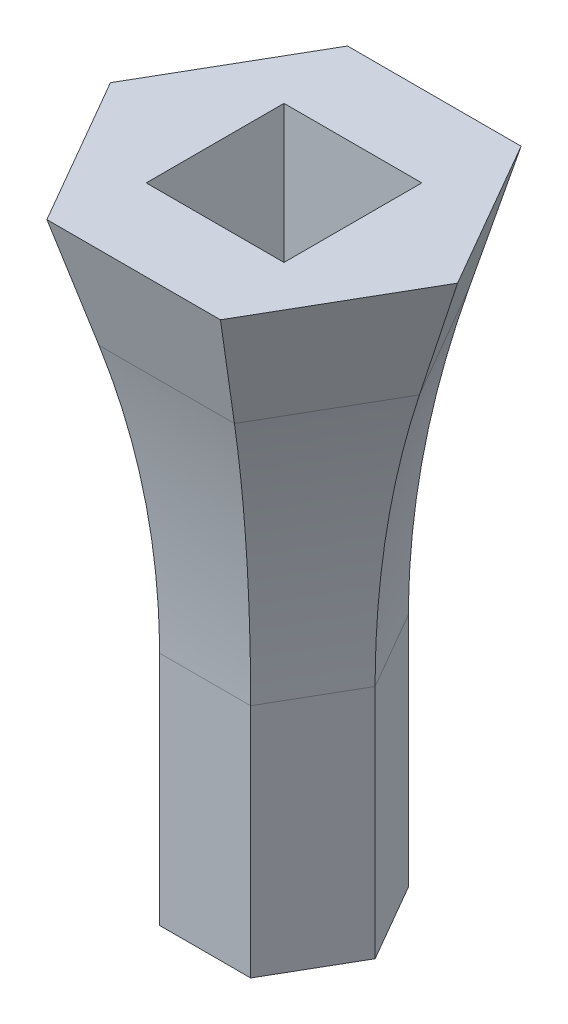
ISO-10303-21;
HEADER;
FILE_DESCRIPTION(('STEP AP214'),'2;1');
FILE_NAME('part.step','',(''),(''),'','','');
FILE_SCHEMA(('AUTOMOTIVE_DESIGN { 1 0 10303 214 1 1 1 1 }'));
ENDSEC;
DATA;
#1=APPLICATION_CONTEXT('core data for automotive mechanical design processes');
#2=APPLICATION_PROTOCOL_DEFINITION('international standard','automotive_design',2000,#1);
#3=PRODUCT_CONTEXT('',#1,'mechanical');
#4=PRODUCT('Part','Part','',(#3));
#5=PRODUCT_RELATED_PRODUCT_CATEGORY('part','',(#4));
#6=PRODUCT_DEFINITION_FORMATION('','',#4);
#7=PRODUCT_DEFINITION_CONTEXT('part definition',#1,'design');
#8=PRODUCT_DEFINITION('design','',#6,#7);
#9=PRODUCT_DEFINITION_SHAPE('','',#8);
#10=(LENGTH_UNIT() NAMED_UNIT(*) SI_UNIT(.MILLI.,.METRE.));
#11=(NAMED_UNIT(*) PLANE_ANGLE_UNIT() SI_UNIT($,.RADIAN.));
#12=(NAMED_UNIT(*) SI_UNIT($,.STERADIAN.) SOLID_ANGLE_UNIT());
#13=UNCERTAINTY_MEASURE_WITH_UNIT(LENGTH_MEASURE(1.E-05),#10,'distance_accuracy_value','');
#14=(GEOMETRIC_REPRESENTATION_CONTEXT(3) GLOBAL_UNCERTAINTY_ASSIGNED_CONTEXT((#13)) GLOBAL_UNIT_ASSIGNED_CONTEXT((#10,
#11,#12)) REPRESENTATION_CONTEXT('',''));
#15=CARTESIAN_POINT('',(0.,0.,0.));
#16=DIRECTION('',(0.,0.,1.));
#17=DIRECTION('',(1.,0.,0.));
#18=AXIS2_PLACEMENT_3D('',#15,#16,#17);
#19=CARTESIAN_POINT('',(-1.81865334794732,15.,3.15));
#20=DIRECTION('',(0.,0.,-1.));
#21=DIRECTION('',(-1.,0.,0.));
#22=AXIS2_PLACEMENT_3D('',#19,#20,#21);
#23=PLANE('',#22);
#24=DIRECTION('',(0.,-1.,0.));
#25=VECTOR('',#24,1.);
#26=CARTESIAN_POINT('',(1.81865334794732,15.,3.15));
#27=LINE('',#26,#25);
#28=CARTESIAN_POINT('',(1.81865334794732,9.41127074963327,3.15));
#29=VERTEX_POINT('',#28);
#30=CARTESIAN_POINT('',(1.81865334794732,0.,3.15));
#31=VERTEX_POINT('',#30);
#32=EDGE_CURVE('E483',#29,#31,#27,.T.);
#33=ORIENTED_EDGE('',*,*,#32,.F.);
#34=DIRECTION('',(1.,0.,0.));
#35=VECTOR('',#34,1.);
#36=CARTESIAN_POINT('',(-1.81865334794732,9.41127074963327,3.15));
#37=LINE('',#36,#35);
#38=CARTESIAN_POINT('',(-1.81865334794732,9.4112707496333,3.15));
#39=VERTEX_POINT('',#38);
#40=EDGE_CURVE('E482',#29,#39,#37,.F.);
#41=ORIENTED_EDGE('',*,*,#40,.T.);
#42=DIRECTION('',(0.,-1.,0.));
#43=VECTOR('',#42,1.);
#44=CARTESIAN_POINT('',(-1.81865334794732,15.,3.15));
#45=LINE('',#44,#43);
#46=CARTESIAN_POINT('',(-1.81865334794732,0.,3.15));
#47=VERTEX_POINT('',#46);
#48=EDGE_CURVE('E506',#39,#47,#45,.T.);
#49=ORIENTED_EDGE('',*,*,#48,.T.);
#50=DIRECTION('',(1.,0.,0.));
#51=VECTOR('',#50,1.);
#52=CARTESIAN_POINT('',(-1.81865334794732,0.,3.15));
#53=LINE('',#52,#51);
#54=EDGE_CURVE('E524',#47,#31,#53,.T.);
#55=ORIENTED_EDGE('',*,*,#54,.T.);
#56=EDGE_LOOP('',(#33,#41,#49,#55));
#57=FACE_BOUND('',#56,.T.);
#58=ADVANCED_FACE('F47',(#57),#23,.F.);
#59=CARTESIAN_POINT('',(1.81865334794732,15.,3.15));
#60=DIRECTION('',(-0.866025403784438,0.,-0.5));
#61=DIRECTION('',(-0.5,0.,0.866025403784439));
#62=AXIS2_PLACEMENT_3D('',#59,#60,#61);
#63=PLANE('',#62);
#64=DIRECTION('',(0.,-1.,0.));
#65=VECTOR('',#64,1.);
#66=CARTESIAN_POINT('',(3.63730669589464,15.,0.));
#67=LINE('',#66,#65);
#68=CARTESIAN_POINT('',(3.63730669589464,9.41127074963329,0.));
#69=VERTEX_POINT('',#68);
#70=CARTESIAN_POINT('',(3.63730669589464,0.,0.));
#71=VERTEX_POINT('',#70);
#72=EDGE_CURVE('E487',#69,#71,#67,.T.);
#73=ORIENTED_EDGE('',*,*,#72,.F.);
#74=DIRECTION('',(0.5,0.,-0.866025403784439));
#75=VECTOR('',#74,1.);
#76=CARTESIAN_POINT('',(1.81865334794733,9.41127074963327,3.15));
#77=LINE('',#76,#75);
#78=EDGE_CURVE('E536',#69,#29,#77,.F.);
#79=ORIENTED_EDGE('',*,*,#78,.T.);
#80=ORIENTED_EDGE('',*,*,#32,.T.);
#81=DIRECTION('',(0.5,0.,-0.866025403784439));
#82=VECTOR('',#81,1.);
#83=CARTESIAN_POINT('',(1.81865334794732,0.,3.15));
#84=LINE('',#83,#82);
#85=EDGE_CURVE('E521',#31,#71,#84,.T.);
#86=ORIENTED_EDGE('',*,*,#85,.T.);
#87=EDGE_LOOP('',(#73,#79,#80,#86));
#88=FACE_BOUND('',#87,.T.);
#89=ADVANCED_FACE('F356',(#88),#63,.F.);
#90=CARTESIAN_POINT('',(3.63730669589464,15.,0.));
#91=DIRECTION('',(-0.866025403784439,0.,0.5));
#92=DIRECTION('',(0.5,0.,0.866025403784439));
#93=AXIS2_PLACEMENT_3D('',#90,#91,#92);
#94=PLANE('',#93);
#95=DIRECTION('',(0.,-1.,0.));
#96=VECTOR('',#95,1.);
#97=CARTESIAN_POINT('',(1.81865334794732,15.,-3.15));
#98=LINE('',#97,#96);
#99=CARTESIAN_POINT('',(1.81865334794732,9.41127074963327,-3.15));
#100=VERTEX_POINT('',#99);
#101=CARTESIAN_POINT('',(1.81865334794732,0.,-3.15));
#102=VERTEX_POINT('',#101);
#103=EDGE_CURVE('E500',#100,#102,#98,.T.);
#104=ORIENTED_EDGE('',*,*,#103,.F.);
#105=DIRECTION('',(-0.5,0.,-0.866025403784439));
#106=VECTOR('',#105,1.);
#107=CARTESIAN_POINT('',(3.63730669589465,9.41127074963329,0.));
#108=LINE('',#107,#106);
#109=EDGE_CURVE('E249',#100,#69,#108,.F.);
#110=ORIENTED_EDGE('',*,*,#109,.T.);
#111=ORIENTED_EDGE('',*,*,#72,.T.);
#112=DIRECTION('',(-0.5,0.,-0.866025403784439));
#113=VECTOR('',#112,1.);
#114=CARTESIAN_POINT('',(3.63730669589464,0.,0.));
#115=LINE('',#114,#113);
#116=EDGE_CURVE('E518',#71,#102,#115,.T.);
#117=ORIENTED_EDGE('',*,*,#116,.T.);
#118=EDGE_LOOP('',(#104,#110,#111,#117));
#119=FACE_BOUND('',#118,.T.);
#120=ADVANCED_FACE('F353',(#119),#94,.F.);
#121=CARTESIAN_POINT('',(1.81865334794732,15.,-3.15));
#122=DIRECTION('',(0.,0.,1.));
#123=DIRECTION('',(1.,0.,0.));
#124=AXIS2_PLACEMENT_3D('',#121,#122,#123);
#125=PLANE('',#124);
#126=DIRECTION('',(0.,-1.,0.));
#127=VECTOR('',#126,1.);
#128=CARTESIAN_POINT('',(-1.81865334794732,15.,-3.15));
#129=LINE('',#128,#127);
#130=CARTESIAN_POINT('',(-1.81865334794732,9.41127074963328,-3.15));
#131=VERTEX_POINT('',#130);
#132=CARTESIAN_POINT('',(-1.81865334794732,0.,-3.15));
#133=VERTEX_POINT('',#132);
#134=EDGE_CURVE('E502',#131,#133,#129,.T.);
#135=ORIENTED_EDGE('',*,*,#134,.F.);
#136=DIRECTION('',(-1.,0.,0.));
#137=VECTOR('',#136,1.);
#138=CARTESIAN_POINT('',(1.81865334794732,9.41127074963327,-3.15));
#139=LINE('',#138,#137);
#140=EDGE_CURVE('E215',#131,#100,#139,.F.);
#141=ORIENTED_EDGE('',*,*,#140,.T.);
#142=ORIENTED_EDGE('',*,*,#103,.T.);
#143=DIRECTION('',(-1.,0.,0.));
#144=VECTOR('',#143,1.);
#145=CARTESIAN_POINT('',(1.81865334794732,0.,-3.15));
#146=LINE('',#145,#144);
#147=EDGE_CURVE('E515',#102,#133,#146,.T.);
#148=ORIENTED_EDGE('',*,*,#147,.T.);
#149=EDGE_LOOP('',(#135,#141,#142,#148));
#150=FACE_BOUND('',#149,.T.);
#151=ADVANCED_FACE('F349',(#150),#125,.F.);
#152=CARTESIAN_POINT('',(-1.81865334794732,15.,-3.15));
#153=DIRECTION('',(0.866025403784438,0.,0.5));
#154=DIRECTION('',(0.5,0.,-0.866025403784439));
#155=AXIS2_PLACEMENT_3D('',#152,#153,#154);
#156=PLANE('',#155);
#157=DIRECTION('',(0.,-1.,0.));
#158=VECTOR('',#157,1.);
#159=CARTESIAN_POINT('',(-3.63730669589464,15.,0.));
#160=LINE('',#159,#158);
#161=CARTESIAN_POINT('',(-3.63730669589464,9.4112707496333,0.));
#162=VERTEX_POINT('',#161);
#163=CARTESIAN_POINT('',(-3.63730669589464,0.,0.));
#164=VERTEX_POINT('',#163);
#165=EDGE_CURVE('E504',#162,#164,#160,.T.);
#166=ORIENTED_EDGE('',*,*,#165,.F.);
#167=DIRECTION('',(-0.5,0.,0.866025403784439));
#168=VECTOR('',#167,1.);
#169=CARTESIAN_POINT('',(-1.81865334794733,9.41127074963328,-3.15000000000001));
#170=LINE('',#169,#168);
#171=EDGE_CURVE('E218',#162,#131,#170,.F.);
#172=ORIENTED_EDGE('',*,*,#171,.T.);
#173=ORIENTED_EDGE('',*,*,#134,.T.);
#174=DIRECTION('',(-0.5,0.,0.866025403784438));
#175=VECTOR('',#174,1.);
#176=CARTESIAN_POINT('',(-1.81865334794732,0.,-3.15));
#177=LINE('',#176,#175);
#178=EDGE_CURVE('E512',#133,#164,#177,.T.);
#179=ORIENTED_EDGE('',*,*,#178,.T.);
#180=EDGE_LOOP('',(#166,#172,#173,#179));
#181=FACE_BOUND('',#180,.T.);
#182=ADVANCED_FACE('F346',(#181),#156,.F.);
#183=CARTESIAN_POINT('',(-3.63730669589464,15.,0.));
#184=DIRECTION('',(0.866025403784439,0.,-0.5));
#185=DIRECTION('',(-0.5,0.,-0.866025403784439));
#186=AXIS2_PLACEMENT_3D('',#183,#184,#185);
#187=PLANE('',#186);
#188=ORIENTED_EDGE('',*,*,#48,.F.);
#189=DIRECTION('',(0.5,0.,0.866025403784439));
#190=VECTOR('',#189,1.);
#191=CARTESIAN_POINT('',(-3.63730669589464,9.4112707496333,0.));
#192=LINE('',#191,#190);
#193=EDGE_CURVE('E12',#39,#162,#192,.F.);
#194=ORIENTED_EDGE('',*,*,#193,.T.);
#195=ORIENTED_EDGE('',*,*,#165,.T.);
#196=DIRECTION('',(0.5,0.,0.866025403784439));
#197=VECTOR('',#196,1.);
#198=CARTESIAN_POINT('',(-3.63730669589464,0.,0.));
#199=LINE('',#198,#197);
#200=EDGE_CURVE('E507',#164,#47,#199,.T.);
#201=ORIENTED_EDGE('',*,*,#200,.T.);
#202=EDGE_LOOP('',(#188,#194,#195,#201));
#203=FACE_BOUND('',#202,.T.);
#204=ADVANCED_FACE('F342',(#203),#187,.F.);
#205=CARTESIAN_POINT('',(0.,0.,0.));
#206=DIRECTION('',(0.,1.,0.));
#207=DIRECTION('',(0.,0.,1.));
#208=AXIS2_PLACEMENT_3D('',#205,#206,#207);
#209=PLANE('',#208);
#210=ORIENTED_EDGE('',*,*,#54,.F.);
#211=ORIENTED_EDGE('',*,*,#200,.F.);
#212=ORIENTED_EDGE('',*,*,#178,.F.);
#213=ORIENTED_EDGE('',*,*,#147,.F.);
#214=ORIENTED_EDGE('',*,*,#116,.F.);
#215=ORIENTED_EDGE('',*,*,#85,.F.);
#216=EDGE_LOOP('',(#210,#211,#212,#213,#214,#215));
#217=FACE_BOUND('',#216,.T.);
#218=ADVANCED_FACE('F338',(#217),#209,.F.);
#219=CARTESIAN_POINT('',(0.,25.,0.));
#220=DIRECTION('',(0.,1.,0.));
#221=DIRECTION('',(0.,0.,1.));
#222=AXIS2_PLACEMENT_3D('',#219,#220,#221);
#223=PLANE('',#222);
#224=DIRECTION('',(0.,0.,-1.));
#225=VECTOR('',#224,1.);
#226=CARTESIAN_POINT('',(2.75,25.,-2.75));
#227=LINE('',#226,#225);
#228=CARTESIAN_POINT('',(2.75,25.,2.75));
#229=VERTEX_POINT('',#228);
#230=CARTESIAN_POINT('',(2.75,25.,-2.75));
#231=VERTEX_POINT('',#230);
#232=EDGE_CURVE('E169',#229,#231,#227,.T.);
#233=ORIENTED_EDGE('',*,*,#232,.F.);
#234=DIRECTION('',(1.,0.,0.));
#235=VECTOR('',#234,1.);
#236=CARTESIAN_POINT('',(-2.75,25.,2.75));
#237=LINE('',#236,#235);
#238=CARTESIAN_POINT('',(-2.75,25.,2.75));
#239=VERTEX_POINT('',#238);
#240=EDGE_CURVE('E186',#239,#229,#237,.T.);
#241=ORIENTED_EDGE('',*,*,#240,.F.);
#242=DIRECTION('',(0.,0.,1.));
#243=VECTOR('',#242,1.);
#244=CARTESIAN_POINT('',(-2.75,25.,-2.75));
#245=LINE('',#244,#243);
#246=CARTESIAN_POINT('',(-2.75,25.,-2.75));
#247=VERTEX_POINT('',#246);
#248=EDGE_CURVE('E189',#247,#239,#245,.T.);
#249=ORIENTED_EDGE('',*,*,#248,.F.);
#250=DIRECTION('',(-1.,0.,0.));
#251=VECTOR('',#250,1.);
#252=CARTESIAN_POINT('',(-2.75,25.,-2.75));
#253=LINE('',#252,#251);
#254=EDGE_CURVE('E195',#231,#247,#253,.T.);
#255=ORIENTED_EDGE('',*,*,#254,.F.);
#256=EDGE_LOOP('',(#233,#241,#249,#255));
#257=FACE_BOUND('',#256,.T.);
#258=DIRECTION('',(1.,0.,0.));
#259=VECTOR('',#258,1.);
#260=CARTESIAN_POINT('',(-3.46410161513775,25.,6.));
#261=LINE('',#260,#259);
#262=CARTESIAN_POINT('',(-3.46410161513775,25.,6.));
#263=VERTEX_POINT('',#262);
#264=CARTESIAN_POINT('',(3.46410161513775,25.,6.));
#265=VERTEX_POINT('',#264);
#266=EDGE_CURVE('E201',#263,#265,#261,.T.);
#267=ORIENTED_EDGE('',*,*,#266,.T.);
#268=DIRECTION('',(0.5,0.,-0.866025403784439));
#269=VECTOR('',#268,1.);
#270=CARTESIAN_POINT('',(3.46410161513775,25.,6.));
#271=LINE('',#270,#269);
#272=CARTESIAN_POINT('',(6.92820323027551,25.,0.));
#273=VERTEX_POINT('',#272);
#274=EDGE_CURVE('E308',#265,#273,#271,.T.);
#275=ORIENTED_EDGE('',*,*,#274,.T.);
#276=DIRECTION('',(-0.5,0.,-0.866025403784438));
#277=VECTOR('',#276,1.);
#278=CARTESIAN_POINT('',(6.92820323027551,25.,0.));
#279=LINE('',#278,#277);
#280=CARTESIAN_POINT('',(3.46410161513776,25.,-6.));
#281=VERTEX_POINT('',#280);
#282=EDGE_CURVE('E323',#273,#281,#279,.T.);
#283=ORIENTED_EDGE('',*,*,#282,.T.);
#284=DIRECTION('',(-1.,0.,0.));
#285=VECTOR('',#284,1.);
#286=CARTESIAN_POINT('',(3.46410161513775,25.,-6.));
#287=LINE('',#286,#285);
#288=CARTESIAN_POINT('',(-3.46410161513775,25.,-6.));
#289=VERTEX_POINT('',#288);
#290=EDGE_CURVE('E446',#281,#289,#287,.T.);
#291=ORIENTED_EDGE('',*,*,#290,.T.);
#292=DIRECTION('',(-0.5,0.,0.866025403784438));
#293=VECTOR('',#292,1.);
#294=CARTESIAN_POINT('',(-3.46410161513775,25.,-6.));
#295=LINE('',#294,#293);
#296=CARTESIAN_POINT('',(-6.92820323027551,25.,0.));
#297=VERTEX_POINT('',#296);
#298=EDGE_CURVE('E456',#289,#297,#295,.T.);
#299=ORIENTED_EDGE('',*,*,#298,.T.);
#300=DIRECTION('',(0.5,0.,0.866025403784438));
#301=VECTOR('',#300,1.);
#302=CARTESIAN_POINT('',(-6.92820323027551,25.,0.));
#303=LINE('',#302,#301);
#304=EDGE_CURVE('E214',#297,#263,#303,.T.);
#305=ORIENTED_EDGE('',*,*,#304,.T.);
#306=EDGE_LOOP('',(#267,#275,#283,#291,#299,#305));
#307=FACE_BOUND('',#306,.T.);
#308=ADVANCED_FACE('F341',(#257,#307),#223,.T.);
#309=CARTESIAN_POINT('',(0.901087728509321,0.296538648292445,0.520243242618325));
#310=DIRECTION('',(0.83286112697402,0.274085979637935,0.480852595856026));
#311=DIRECTION('',(0.5,0.,-0.866025403784439));
#312=AXIS2_PLACEMENT_3D('',#309,#310,#311);
#313=PLANE('',#312);
#314=DIRECTION('',(-0.156298772050665,0.949885664394309,-0.270717414352378));
#315=VECTOR('',#314,1.);
#316=CARTESIAN_POINT('',(-1.81865334794732,15.,-3.15));
#317=LINE('',#316,#315);
#318=CARTESIAN_POINT('',(-2.70303406289181,20.3747099351507,-4.68179233151794));
#319=VERTEX_POINT('',#318);
#320=EDGE_CURVE('E213',#319,#289,#317,.T.);
#321=ORIENTED_EDGE('',*,*,#320,.F.);
#322=DIRECTION('',(-0.5,0.,0.866025403784439));
#323=VECTOR('',#322,1.);
#324=CARTESIAN_POINT('',(-4.96387776831138,20.3747099351507,-0.765896165758971));
#325=LINE('',#324,#323);
#326=CARTESIAN_POINT('',(-5.40606812578362,20.3747099351507,0.));
#327=VERTEX_POINT('',#326);
#328=EDGE_CURVE('E70',#319,#327,#325,.T.);
#329=ORIENTED_EDGE('',*,*,#328,.T.);
#330=DIRECTION('',(-0.31259754410133,0.949885664394309,0.));
#331=VECTOR('',#330,1.);
#332=CARTESIAN_POINT('',(-3.63730669589464,15.,0.));
#333=LINE('',#332,#331);
#334=EDGE_CURVE('E210',#327,#297,#333,.T.);
#335=ORIENTED_EDGE('',*,*,#334,.T.);
#336=ORIENTED_EDGE('',*,*,#298,.F.);
#337=EDGE_LOOP('',(#321,#329,#335,#336));
#338=FACE_BOUND('',#337,.T.);
#339=ADVANCED_FACE('F403',(#338),#313,.F.);
#340=CARTESIAN_POINT('',(0.,0.296538648292446,1.04048648523665));
#341=DIRECTION('',(0.,0.274085979637935,0.961705191712051));
#342=DIRECTION('',(0.,-0.961705191712051,0.274085979637935));
#343=AXIS2_PLACEMENT_3D('',#340,#341,#342);
#344=PLANE('',#343);
#345=DIRECTION('',(0.156298772050665,0.949885664394309,-0.270717414352378));
#346=VECTOR('',#345,1.);
#347=CARTESIAN_POINT('',(1.81865334794732,15.,-3.15));
#348=LINE('',#347,#346);
#349=CARTESIAN_POINT('',(2.70303406289181,20.3747099351507,-4.68179233151794));
#350=VERTEX_POINT('',#349);
#351=EDGE_CURVE('E494',#350,#281,#348,.T.);
#352=ORIENTED_EDGE('',*,*,#351,.F.);
#353=DIRECTION('',(-1.,0.,0.));
#354=VECTOR('',#353,1.);
#355=CARTESIAN_POINT('',(-1.81865334794732,20.3747099351507,-4.68179233151794));
#356=LINE('',#355,#354);
#357=EDGE_CURVE('E245',#350,#319,#356,.T.);
#358=ORIENTED_EDGE('',*,*,#357,.T.);
#359=ORIENTED_EDGE('',*,*,#320,.T.);
#360=ORIENTED_EDGE('',*,*,#290,.F.);
#361=EDGE_LOOP('',(#352,#358,#359,#360));
#362=FACE_BOUND('',#361,.T.);
#363=ADVANCED_FACE('F285',(#362),#344,.F.);
#364=CARTESIAN_POINT('',(0.901087728509319,0.296538648292444,-0.520243242618324));
#365=DIRECTION('',(0.83286112697402,0.274085979637934,-0.480852595856026));
#366=DIRECTION('',(-0.5,0.,-0.866025403784439));
#367=AXIS2_PLACEMENT_3D('',#364,#365,#366);
#368=PLANE('',#367);
#369=ORIENTED_EDGE('',*,*,#334,.F.);
#370=DIRECTION('',(0.5,0.,0.866025403784439));
#371=VECTOR('',#370,1.);
#372=CARTESIAN_POINT('',(-3.14522442036406,20.3747099351507,3.91589616575897));
#373=LINE('',#372,#371);
#374=CARTESIAN_POINT('',(-2.70303406289181,20.3747099351507,4.68179233151794));
#375=VERTEX_POINT('',#374);
#376=EDGE_CURVE('E56',#327,#375,#373,.T.);
#377=ORIENTED_EDGE('',*,*,#376,.T.);
#378=DIRECTION('',(-0.156298772050665,0.949885664394309,0.270717414352378));
#379=VECTOR('',#378,1.);
#380=CARTESIAN_POINT('',(-1.81865334794732,15.,3.15));
#381=LINE('',#380,#379);
#382=EDGE_CURVE('E256',#375,#263,#381,.T.);
#383=ORIENTED_EDGE('',*,*,#382,.T.);
#384=ORIENTED_EDGE('',*,*,#304,.F.);
#385=EDGE_LOOP('',(#369,#377,#383,#384));
#386=FACE_BOUND('',#385,.T.);
#387=ADVANCED_FACE('F274',(#386),#368,.F.);
#388=CARTESIAN_POINT('',(0.,0.296538648292443,-1.04048648523664));
#389=DIRECTION('',(0.,0.274085979637934,-0.961705191712052));
#390=DIRECTION('',(0.,0.961705191712052,0.274085979637934));
#391=AXIS2_PLACEMENT_3D('',#388,#389,#390);
#392=PLANE('',#391);
#393=ORIENTED_EDGE('',*,*,#382,.F.);
#394=DIRECTION('',(1.,0.,0.));
#395=VECTOR('',#394,1.);
#396=CARTESIAN_POINT('',(1.81865334794732,20.3747099351506,4.68179233151794));
#397=LINE('',#396,#395);
#398=CARTESIAN_POINT('',(2.7030340628918,20.3747099351506,4.68179233151793));
#399=VERTEX_POINT('',#398);
#400=EDGE_CURVE('E479',#375,#399,#397,.T.);
#401=ORIENTED_EDGE('',*,*,#400,.T.);
#402=DIRECTION('',(0.156298772050665,0.949885664394309,0.270717414352378));
#403=VECTOR('',#402,1.);
#404=CARTESIAN_POINT('',(1.81865334794732,15.,3.15));
#405=LINE('',#404,#403);
#406=EDGE_CURVE('E495',#399,#265,#405,.T.);
#407=ORIENTED_EDGE('',*,*,#406,.T.);
#408=ORIENTED_EDGE('',*,*,#266,.F.);
#409=EDGE_LOOP('',(#393,#401,#407,#408));
#410=FACE_BOUND('',#409,.T.);
#411=ADVANCED_FACE('F284',(#410),#392,.F.);
#412=CARTESIAN_POINT('',(-0.901087728509316,0.296538648292443,-0.520243242618322));
#413=DIRECTION('',(-0.83286112697402,0.274085979637934,-0.480852595856026));
#414=DIRECTION('',(-0.5,0.,0.866025403784439));
#415=AXIS2_PLACEMENT_3D('',#412,#413,#414);
#416=PLANE('',#415);
#417=ORIENTED_EDGE('',*,*,#406,.F.);
#418=DIRECTION('',(0.5,0.,-0.866025403784439));
#419=VECTOR('',#418,1.);
#420=CARTESIAN_POINT('',(4.96387776831136,20.3747099351506,0.765896165758964));
#421=LINE('',#420,#419);
#422=CARTESIAN_POINT('',(5.40606812578362,20.3747099351507,0.));
#423=VERTEX_POINT('',#422);
#424=EDGE_CURVE('E485',#399,#423,#421,.T.);
#425=ORIENTED_EDGE('',*,*,#424,.T.);
#426=DIRECTION('',(0.31259754410133,0.949885664394309,0.));
#427=VECTOR('',#426,1.);
#428=CARTESIAN_POINT('',(3.63730669589464,15.,0.));
#429=LINE('',#428,#427);
#430=EDGE_CURVE('E492',#423,#273,#429,.T.);
#431=ORIENTED_EDGE('',*,*,#430,.T.);
#432=ORIENTED_EDGE('',*,*,#274,.F.);
#433=EDGE_LOOP('',(#417,#425,#431,#432));
#434=FACE_BOUND('',#433,.T.);
#435=ADVANCED_FACE('F291',(#434),#416,.F.);
#436=CARTESIAN_POINT('',(-0.901087728509323,0.296538648292446,0.520243242618326));
#437=DIRECTION('',(-0.83286112697402,0.274085979637935,0.480852595856026));
#438=DIRECTION('',(0.5,0.,0.866025403784439));
#439=AXIS2_PLACEMENT_3D('',#436,#437,#438);
#440=PLANE('',#439);
#441=ORIENTED_EDGE('',*,*,#430,.F.);
#442=DIRECTION('',(-0.5,0.,-0.866025403784439));
#443=VECTOR('',#442,1.);
#444=CARTESIAN_POINT('',(3.14522442036407,20.3747099351507,-3.91589616575897));
#445=LINE('',#444,#443);
#446=EDGE_CURVE('E252',#423,#350,#445,.T.);
#447=ORIENTED_EDGE('',*,*,#446,.T.);
#448=ORIENTED_EDGE('',*,*,#351,.T.);
#449=ORIENTED_EDGE('',*,*,#282,.F.);
#450=EDGE_LOOP('',(#441,#447,#448,#449));
#451=FACE_BOUND('',#450,.T.);
#452=ADVANCED_FACE('F329',(#451),#440,.F.);
#453=CARTESIAN_POINT('',(2.75,19.,-2.75));
#454=DIRECTION('',(1.,0.,0.));
#455=DIRECTION('',(0.,0.,-1.));
#456=AXIS2_PLACEMENT_3D('',#453,#454,#455);
#457=PLANE('',#456);
#458=ORIENTED_EDGE('',*,*,#232,.T.);
#459=DIRECTION('',(0.,1.,0.));
#460=VECTOR('',#459,1.);
#461=CARTESIAN_POINT('',(2.75,19.,-2.75));
#462=LINE('',#461,#460);
#463=CARTESIAN_POINT('',(2.75,19.,-2.75));
#464=VERTEX_POINT('',#463);
#465=EDGE_CURVE('E162',#464,#231,#462,.T.);
#466=ORIENTED_EDGE('',*,*,#465,.F.);
#467=DIRECTION('',(0.,0.,-1.));
#468=VECTOR('',#467,1.);
#469=CARTESIAN_POINT('',(2.75,19.,-2.75));
#470=LINE('',#469,#468);
#471=CARTESIAN_POINT('',(2.75,19.,2.75));
#472=VERTEX_POINT('',#471);
#473=EDGE_CURVE('E166',#472,#464,#470,.T.);
#474=ORIENTED_EDGE('',*,*,#473,.F.);
#475=DIRECTION('',(0.,1.,0.));
#476=VECTOR('',#475,1.);
#477=CARTESIAN_POINT('',(2.75,19.,2.75));
#478=LINE('',#477,#476);
#479=EDGE_CURVE('E199',#472,#229,#478,.T.);
#480=ORIENTED_EDGE('',*,*,#479,.T.);
#481=EDGE_LOOP('',(#458,#466,#474,#480));
#482=FACE_BOUND('',#481,.T.);
#483=ADVANCED_FACE('F164',(#482),#457,.F.);
#484=CARTESIAN_POINT('',(-2.75,19.,2.75));
#485=DIRECTION('',(0.,0.,1.));
#486=DIRECTION('',(1.,0.,0.));
#487=AXIS2_PLACEMENT_3D('',#484,#485,#486);
#488=PLANE('',#487);
#489=ORIENTED_EDGE('',*,*,#240,.T.);
#490=ORIENTED_EDGE('',*,*,#479,.F.);
#491=DIRECTION('',(1.,0.,0.));
#492=VECTOR('',#491,1.);
#493=CARTESIAN_POINT('',(-2.75,19.,2.75));
#494=LINE('',#493,#492);
#495=CARTESIAN_POINT('',(-2.75,19.,2.75));
#496=VERTEX_POINT('',#495);
#497=EDGE_CURVE('E174',#496,#472,#494,.T.);
#498=ORIENTED_EDGE('',*,*,#497,.F.);
#499=DIRECTION('',(0.,1.,0.));
#500=VECTOR('',#499,1.);
#501=CARTESIAN_POINT('',(-2.75,19.,2.75));
#502=LINE('',#501,#500);
#503=EDGE_CURVE('E202',#496,#239,#502,.T.);
#504=ORIENTED_EDGE('',*,*,#503,.T.);
#505=EDGE_LOOP('',(#489,#490,#498,#504));
#506=FACE_BOUND('',#505,.T.);
#507=ADVANCED_FACE('F392',(#506),#488,.F.);
#508=CARTESIAN_POINT('',(-2.75,19.,-2.75));
#509=DIRECTION('',(-1.,0.,0.));
#510=DIRECTION('',(0.,0.,1.));
#511=AXIS2_PLACEMENT_3D('',#508,#509,#510);
#512=PLANE('',#511);
#513=ORIENTED_EDGE('',*,*,#248,.T.);
#514=ORIENTED_EDGE('',*,*,#503,.F.);
#515=DIRECTION('',(0.,0.,1.));
#516=VECTOR('',#515,1.);
#517=CARTESIAN_POINT('',(-2.75,19.,-2.75));
#518=LINE('',#517,#516);
#519=CARTESIAN_POINT('',(-2.75,19.,-2.75));
#520=VERTEX_POINT('',#519);
#521=EDGE_CURVE('E182',#520,#496,#518,.T.);
#522=ORIENTED_EDGE('',*,*,#521,.F.);
#523=DIRECTION('',(0.,1.,0.));
#524=VECTOR('',#523,1.);
#525=CARTESIAN_POINT('',(-2.75,19.,-2.75));
#526=LINE('',#525,#524);
#527=EDGE_CURVE('E173',#520,#247,#526,.T.);
#528=ORIENTED_EDGE('',*,*,#527,.T.);
#529=EDGE_LOOP('',(#513,#514,#522,#528));
#530=FACE_BOUND('',#529,.T.);
#531=ADVANCED_FACE('F389',(#530),#512,.F.);
#532=CARTESIAN_POINT('',(-2.75,19.,-2.75));
#533=DIRECTION('',(0.,0.,-1.));
#534=DIRECTION('',(-1.,0.,0.));
#535=AXIS2_PLACEMENT_3D('',#532,#533,#534);
#536=PLANE('',#535);
#537=ORIENTED_EDGE('',*,*,#254,.T.);
#538=ORIENTED_EDGE('',*,*,#527,.F.);
#539=DIRECTION('',(-1.,0.,0.));
#540=VECTOR('',#539,1.);
#541=CARTESIAN_POINT('',(-2.75,19.,-2.75));
#542=LINE('',#541,#540);
#543=EDGE_CURVE('E177',#464,#520,#542,.T.);
#544=ORIENTED_EDGE('',*,*,#543,.F.);
#545=ORIENTED_EDGE('',*,*,#465,.T.);
#546=EDGE_LOOP('',(#537,#538,#544,#545));
#547=FACE_BOUND('',#546,.T.);
#548=ADVANCED_FACE('F178',(#547),#536,.F.);
#549=CARTESIAN_POINT('',(0.,19.,0.));
#550=DIRECTION('',(0.,1.,0.));
#551=DIRECTION('',(0.,0.,1.));
#552=AXIS2_PLACEMENT_3D('',#549,#550,#551);
#553=PLANE('',#552);
#554=ORIENTED_EDGE('',*,*,#473,.T.);
#555=ORIENTED_EDGE('',*,*,#543,.T.);
#556=ORIENTED_EDGE('',*,*,#521,.T.);
#557=ORIENTED_EDGE('',*,*,#497,.T.);
#558=EDGE_LOOP('',(#554,#555,#556,#557));
#559=FACE_BOUND('',#558,.T.);
#560=ADVANCED_FACE('F184',(#559),#553,.T.);
#561=CARTESIAN_POINT('',(0.,9.41127074963327,-43.15));
#562=DIRECTION('',(1.,0.,0.));
#563=DIRECTION('',(0.,1.,0.));
#564=AXIS2_PLACEMENT_3D('',#561,#562,#563);
#565=CYLINDRICAL_SURFACE('',#564,40.);
#566=CARTESIAN_POINT('',(24.9126641155324,9.4112707496333,-43.15));
#567=DIRECTION('',(0.866025403784439,0.,0.5));
#568=DIRECTION('',(0.5,0.,-0.866025403784439));
#569=AXIS2_PLACEMENT_3D('',#566,#567,#568);
#570=ELLIPSE('',#569,46.1880215351701,40.);
#571=EDGE_CURVE('E230',#100,#350,#570,.F.);
#572=ORIENTED_EDGE('',*,*,#571,.F.);
#573=ORIENTED_EDGE('',*,*,#140,.F.);
#574=CARTESIAN_POINT('',(-24.9126641155323,9.41127074963329,-43.15));
#575=DIRECTION('',(0.866025403784439,0.,-0.5));
#576=DIRECTION('',(-0.5,0.,-0.866025403784439));
#577=AXIS2_PLACEMENT_3D('',#574,#575,#576);
#578=ELLIPSE('',#577,46.1880215351701,40.);
#579=EDGE_CURVE('E51',#319,#131,#578,.T.);
#580=ORIENTED_EDGE('',*,*,#579,.F.);
#581=ORIENTED_EDGE('',*,*,#357,.F.);
#582=EDGE_LOOP('',(#572,#573,#580,#581));
#583=FACE_BOUND('',#582,.T.);
#584=ADVANCED_FACE('F49',(#583),#565,.F.);
#585=CARTESIAN_POINT('',(-37.3689961732985,9.41127074963328,-21.575));
#586=DIRECTION('',(0.5,0.,-0.866025403784439));
#587=DIRECTION('',(-0.866025403784439,0.,-0.5));
#588=AXIS2_PLACEMENT_3D('',#585,#586,#587);
#589=CYLINDRICAL_SURFACE('',#588,40.);
#590=ORIENTED_EDGE('',*,*,#579,.T.);
#591=ORIENTED_EDGE('',*,*,#171,.F.);
#592=CARTESIAN_POINT('',(-49.8253282310647,9.41127074963328,0.));
#593=DIRECTION('',(0.,0.,-1.));
#594=DIRECTION('',(-1.,0.,0.));
#595=AXIS2_PLACEMENT_3D('',#592,#593,#594);
#596=ELLIPSE('',#595,46.1880215351701,40.);
#597=EDGE_CURVE('E228',#327,#162,#596,.T.);
#598=ORIENTED_EDGE('',*,*,#597,.F.);
#599=ORIENTED_EDGE('',*,*,#328,.F.);
#600=EDGE_LOOP('',(#590,#591,#598,#599));
#601=FACE_BOUND('',#600,.T.);
#602=ADVANCED_FACE('F240',(#601),#589,.F.);
#603=CARTESIAN_POINT('',(37.3689961732985,9.4112707496333,-21.575));
#604=DIRECTION('',(0.5,0.,0.866025403784439));
#605=DIRECTION('',(0.866025403784439,0.,-0.5));
#606=AXIS2_PLACEMENT_3D('',#603,#604,#605);
#607=CYLINDRICAL_SURFACE('',#606,40.);
#608=ORIENTED_EDGE('',*,*,#571,.T.);
#609=ORIENTED_EDGE('',*,*,#446,.F.);
#610=CARTESIAN_POINT('',(49.8253282310647,9.41127074963328,0.));
#611=DIRECTION('',(0.,0.,1.));
#612=DIRECTION('',(1.,0.,0.));
#613=AXIS2_PLACEMENT_3D('',#610,#611,#612);
#614=ELLIPSE('',#613,46.1880215351701,40.);
#615=EDGE_CURVE('E225',#69,#423,#614,.F.);
#616=ORIENTED_EDGE('',*,*,#615,.F.);
#617=ORIENTED_EDGE('',*,*,#109,.F.);
#618=EDGE_LOOP('',(#608,#609,#616,#617));
#619=FACE_BOUND('',#618,.T.);
#620=ADVANCED_FACE('F375',(#619),#607,.F.);
#621=CARTESIAN_POINT('',(-37.3689961732985,9.4112707496333,21.575));
#622=DIRECTION('',(-0.5,0.,-0.866025403784439));
#623=DIRECTION('',(-0.866025403784439,0.,0.5));
#624=AXIS2_PLACEMENT_3D('',#621,#622,#623);
#625=CYLINDRICAL_SURFACE('',#624,40.);
#626=ORIENTED_EDGE('',*,*,#597,.T.);
#627=ORIENTED_EDGE('',*,*,#193,.F.);
#628=CARTESIAN_POINT('',(-24.9126641155324,9.41127074963328,43.15));
#629=DIRECTION('',(-0.866025403784439,0.,-0.5));
#630=DIRECTION('',(0.5,0.,-0.866025403784439));
#631=AXIS2_PLACEMENT_3D('',#628,#629,#630);
#632=ELLIPSE('',#631,46.1880215351701,40.);
#633=EDGE_CURVE('E223',#375,#39,#632,.T.);
#634=ORIENTED_EDGE('',*,*,#633,.F.);
#635=ORIENTED_EDGE('',*,*,#376,.F.);
#636=EDGE_LOOP('',(#626,#627,#634,#635));
#637=FACE_BOUND('',#636,.T.);
#638=ADVANCED_FACE('F371',(#637),#625,.F.);
#639=CARTESIAN_POINT('',(37.3689961732985,9.41127074963327,21.575));
#640=DIRECTION('',(-0.5,0.,0.866025403784439));
#641=DIRECTION('',(0.866025403784439,0.,0.5));
#642=AXIS2_PLACEMENT_3D('',#639,#640,#641);
#643=CYLINDRICAL_SURFACE('',#642,40.);
#644=ORIENTED_EDGE('',*,*,#615,.T.);
#645=ORIENTED_EDGE('',*,*,#424,.F.);
#646=CARTESIAN_POINT('',(24.9126641155323,9.41127074963327,43.15));
#647=DIRECTION('',(-0.866025403784439,0.,0.5));
#648=DIRECTION('',(0.5,0.,0.866025403784439));
#649=AXIS2_PLACEMENT_3D('',#646,#647,#648);
#650=ELLIPSE('',#649,46.1880215351701,40.);
#651=EDGE_CURVE('E221',#29,#399,#650,.F.);
#652=ORIENTED_EDGE('',*,*,#651,.F.);
#653=ORIENTED_EDGE('',*,*,#78,.F.);
#654=EDGE_LOOP('',(#644,#645,#652,#653));
#655=FACE_BOUND('',#654,.T.);
#656=ADVANCED_FACE('F367',(#655),#643,.F.);
#657=CARTESIAN_POINT('',(0.,9.41127074963327,43.15));
#658=DIRECTION('',(-1.,0.,0.));
#659=DIRECTION('',(0.,-1.,0.));
#660=AXIS2_PLACEMENT_3D('',#657,#658,#659);
#661=CYLINDRICAL_SURFACE('',#660,40.);
#662=ORIENTED_EDGE('',*,*,#633,.T.);
#663=ORIENTED_EDGE('',*,*,#40,.F.);
#664=ORIENTED_EDGE('',*,*,#651,.T.);
#665=ORIENTED_EDGE('',*,*,#400,.F.);
#666=EDGE_LOOP('',(#662,#663,#664,#665));
#667=FACE_BOUND('',#666,.T.);
#668=ADVANCED_FACE('F364',(#667),#661,.F.);
#669=CLOSED_SHELL('',(#58,#89,#120,#151,#182,#204,#218,#308,#339,#363,#387,#411,#435,#452,#483,
#507,#531,#548,#560,#584,#602,#620,#638,#656,#668));
#670=MANIFOLD_SOLID_BREP('B2',#669);
#671=ADVANCED_BREP_SHAPE_REPRESENTATION('',(#18,#670),#14);
#672=SHAPE_DEFINITION_REPRESENTATION(#9,#671);
ENDSEC;
END-ISO-10303-21;
